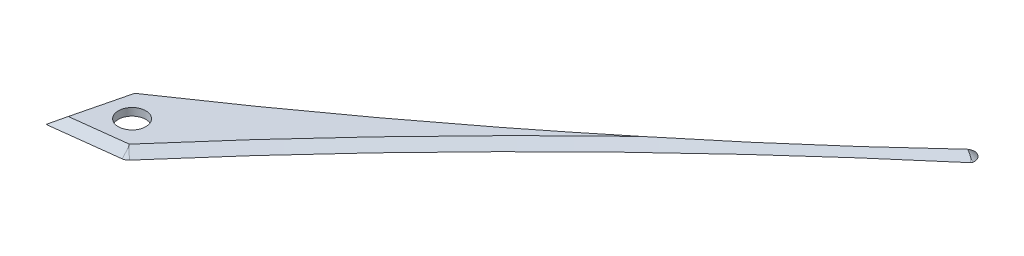
ISO-10303-21;
HEADER;
FILE_DESCRIPTION(('STEP AP214'),'2;1');
FILE_NAME('part.step','',(''),(''),'','','');
FILE_SCHEMA(('AUTOMOTIVE_DESIGN { 1 0 10303 214 1 1 1 1 }'));
ENDSEC;
DATA;
#1=APPLICATION_CONTEXT('core data for automotive mechanical design processes');
#2=APPLICATION_PROTOCOL_DEFINITION('international standard','automotive_design',2000,#1);
#3=PRODUCT_CONTEXT('',#1,'mechanical');
#4=PRODUCT('Part','Part','',(#3));
#5=PRODUCT_RELATED_PRODUCT_CATEGORY('part','',(#4));
#6=PRODUCT_DEFINITION_FORMATION('','',#4);
#7=PRODUCT_DEFINITION_CONTEXT('part definition',#1,'design');
#8=PRODUCT_DEFINITION('design','',#6,#7);
#9=PRODUCT_DEFINITION_SHAPE('','',#8);
#10=(LENGTH_UNIT() NAMED_UNIT(*) SI_UNIT(.MILLI.,.METRE.));
#11=(NAMED_UNIT(*) PLANE_ANGLE_UNIT() SI_UNIT($,.RADIAN.));
#12=(NAMED_UNIT(*) SI_UNIT($,.STERADIAN.) SOLID_ANGLE_UNIT());
#13=UNCERTAINTY_MEASURE_WITH_UNIT(LENGTH_MEASURE(1.E-05),#10,'distance_accuracy_value','');
#14=(GEOMETRIC_REPRESENTATION_CONTEXT(3) GLOBAL_UNCERTAINTY_ASSIGNED_CONTEXT((#13)) GLOBAL_UNIT_ASSIGNED_CONTEXT((#10,
#11,#12)) REPRESENTATION_CONTEXT('',''));
#15=CARTESIAN_POINT('',(0.,0.,0.));
#16=DIRECTION('',(0.,0.,1.));
#17=DIRECTION('',(1.,0.,0.));
#18=AXIS2_PLACEMENT_3D('',#15,#16,#17);
#19=CARTESIAN_POINT('',(-41.4295612310237,1.23498613795335,35.911720589093));
#20=DIRECTION('',(0.,-1.,0.));
#21=DIRECTION('',(0.,0.,1.));
#22=AXIS2_PLACEMENT_3D('',#19,#20,#21);
#23=CONICAL_SURFACE('',#22,0.17544,0.872664625997167);
#24=DIRECTION('',(-0.743844620437363,-0.642787609686538,-0.183082684817168));
#25=VECTOR('',#24,1.);
#26=CARTESIAN_POINT('',(-41.5999170130958,1.23498613795335,35.8697908727262));
#27=LINE('',#26,#25);
#28=CARTESIAN_POINT('',(-41.4295612310237,1.38219777724709,35.911720589093));
#29=VERTEX_POINT('',#28);
#30=CARTESIAN_POINT('',(-41.5999170130958,1.23498613795335,35.8697908727262));
#31=VERTEX_POINT('',#30);
#32=EDGE_CURVE('E239',#29,#31,#27,.T.);
#33=ORIENTED_EDGE('',*,*,#32,.F.);
#34=DIRECTION('',(-0.426164389285027,-0.642787609686538,-0.636559504004761));
#35=VECTOR('',#34,1.);
#36=CARTESIAN_POINT('',(-41.5271616785274,1.23498613795335,35.7659353146409));
#37=LINE('',#36,#35);
#38=CARTESIAN_POINT('',(-41.5271616785274,1.23498613795335,35.7659353146409));
#39=VERTEX_POINT('',#38);
#40=EDGE_CURVE('E12',#29,#39,#37,.T.);
#41=ORIENTED_EDGE('',*,*,#40,.T.);
#42=CARTESIAN_POINT('',(-41.4295612310237,1.23498613795335,35.911720589093));
#43=DIRECTION('',(0.,1.,0.));
#44=DIRECTION('',(0.,0.,1.));
#45=AXIS2_PLACEMENT_3D('',#42,#43,#44);
#46=CIRCLE('',#45,0.17544);
#47=EDGE_CURVE('E238',#31,#39,#46,.F.);
#48=ORIENTED_EDGE('',*,*,#47,.F.);
#49=EDGE_LOOP('',(#33,#41,#48));
#50=FACE_BOUND('',#49,.T.);
#51=ADVANCED_FACE('F94',(#50),#23,.T.);
#52=CARTESIAN_POINT('',(-48.2539668191453,1.23498613795335,32.2725586456981));
#53=DIRECTION('',(0.,1.,0.));
#54=DIRECTION('',(0.,0.,1.));
#55=AXIS2_PLACEMENT_3D('',#52,#53,#54);
#56=PLANE('',#55);
#57=CARTESIAN_POINT('',(-40.9169721093054,1.23498613795335,36.4773777946306));
#58=DIRECTION('',(0.,1.,0.));
#59=DIRECTION('',(0.,0.,1.));
#60=AXIS2_PLACEMENT_3D('',#57,#58,#59);
#61=CIRCLE('',#60,0.32164);
#62=CARTESIAN_POINT('',(-40.9169721093054,1.23498613795335,36.7990177946306));
#63=VERTEX_POINT('',#62);
#64=EDGE_CURVE('E314',#63,#63,#61,.T.);
#65=ORIENTED_EDGE('',*,*,#64,.T.);
#66=EDGE_LOOP('',(#65));
#67=FACE_BOUND('',#66,.T.);
#68=CARTESIAN_POINT('',(-41.5271616785274,1.23498613795335,35.7659353146409));
#69=CARTESIAN_POINT('',(-41.2057811120871,1.23498613795335,35.5507780039952));
#70=CARTESIAN_POINT('',(-40.8858527182257,1.23498613795335,35.333451650702));
#71=CARTESIAN_POINT('',(-40.2492418621971,1.23498613795335,34.894699299918));
#72=CARTESIAN_POINT('',(-39.9325567508154,1.23498613795335,34.6732771463246));
#73=CARTESIAN_POINT('',(-39.3024233738779,1.23498613795335,34.2263457961842));
#74=CARTESIAN_POINT('',(-38.9889729599727,1.23498613795335,34.0008396285886));
#75=CARTESIAN_POINT('',(-38.365299309899,1.23498613795335,33.5457536261096));
#76=CARTESIAN_POINT('',(-38.0550744435247,1.23498613795335,33.3161760253136));
#77=CARTESIAN_POINT('',(-37.4378423870001,1.23498613795335,32.8529602544979));
#78=CARTESIAN_POINT('',(-37.1308341000104,1.23498613795335,32.619323545983));
#79=CARTESIAN_POINT('',(-36.5200256682486,1.23498613795335,32.1480026603006));
#80=CARTESIAN_POINT('',(-36.2162249738218,1.23498613795335,31.9103191954422));
#81=CARTESIAN_POINT('',(-35.6118277650167,1.23498613795335,31.430922223419));
#82=CARTESIAN_POINT('',(-35.3112312016629,1.23498613795335,31.1892087779982));
#83=CARTESIAN_POINT('',(-34.7132261327837,1.23498613795335,30.7017597881303));
#84=CARTESIAN_POINT('',(-34.4158182173654,1.23498613795335,30.4560235197588));
#85=CARTESIAN_POINT('',(-33.8241800762311,1.23498613795335,29.9605409735351));
#86=CARTESIAN_POINT('',(-33.5299510300754,1.23498613795335,29.7107932872633));
#87=CARTESIAN_POINT('',(-32.9446602616333,1.23498613795335,29.2072999196093));
#88=CARTESIAN_POINT('',(-32.6536003159474,1.23498613795335,28.9535521730698));
#89=CARTESIAN_POINT('',(-32.0746376565497,1.23498613795335,28.4420704745345));
#90=CARTESIAN_POINT('',(-31.7867373225919,1.23498613795335,28.1843338289877));
#91=CARTESIAN_POINT('',(-31.2140830599226,1.23498613795335,27.6648864548719));
#92=CARTESIAN_POINT('',(-30.929332117825,1.23498613795335,27.4031724336872));
#93=CARTESIAN_POINT('',(-30.6462986840173,1.23498613795335,27.1396145595264));
#94=B_SPLINE_CURVE_WITH_KNOTS('',3,(#68,#69,#70,#71,#72,#73,#74,#75,#76,#77,#78,#79,#80,#81,#82,
#83,#84,#85,#86,#87,#88,#89,#90,#91,#92,#93),.UNSPECIFIED.,.F.,.F.,(4,2,2,2,2,2,2,2,2,2,2,2,4),
(0.,1.16025112051873,2.3194636529408,3.47784905451846,4.63561736992129,5.79297712574353,
6.95013522739013,8.10727561627494,9.26462657791227,10.422393178553,11.580778474926,
12.7399834328891,13.9002068496202),.UNSPECIFIED.);
#95=CARTESIAN_POINT('',(-30.6462986840173,1.23498613795335,27.1396145595264));
#96=VERTEX_POINT('',#95);
#97=EDGE_CURVE('E231',#39,#96,#94,.T.);
#98=ORIENTED_EDGE('',*,*,#97,.T.);
#99=CARTESIAN_POINT('',(-30.6064458298212,1.23498613795335,27.1824124614893));
#100=DIRECTION('',(0.,1.,0.));
#101=DIRECTION('',(0.,0.,1.));
#102=AXIS2_PLACEMENT_3D('',#99,#100,#101);
#103=CIRCLE('',#102,0.0584799999999992);
#104=CARTESIAN_POINT('',(-30.6059550477662,1.23498613795335,27.1239345209221));
#105=VERTEX_POINT('',#104);
#106=EDGE_CURVE('E274',#105,#96,#103,.T.);
#107=ORIENTED_EDGE('',*,*,#106,.F.);
#108=CARTESIAN_POINT('',(-30.607764340602,1.23498613795335,27.3395164026345));
#109=DIRECTION('',(0.,1.,0.));
#110=DIRECTION('',(0.,0.,1.));
#111=AXIS2_PLACEMENT_3D('',#108,#109,#110);
#112=CIRCLE('',#111,0.215589473915584);
#113=CARTESIAN_POINT('',(-30.3935238800785,1.23498613795335,27.3635964013441));
#114=VERTEX_POINT('',#113);
#115=EDGE_CURVE('E306',#114,#105,#112,.T.);
#116=ORIENTED_EDGE('',*,*,#115,.F.);
#117=CARTESIAN_POINT('',(-30.4516379517159,1.23498613795335,27.3570645503267));
#118=DIRECTION('',(0.,-1.,0.));
#119=DIRECTION('',(0.,0.,-1.));
#120=AXIS2_PLACEMENT_3D('',#117,#118,#119);
#121=CIRCLE('',#120,0.0584800000000016);
#122=CARTESIAN_POINT('',(-30.4139329881333,1.23498613795335,27.4017662966151));
#123=VERTEX_POINT('',#122);
#124=EDGE_CURVE('E310',#114,#123,#121,.T.);
#125=ORIENTED_EDGE('',*,*,#124,.T.);
#126=CARTESIAN_POINT('',(-40.2839139579828,1.23498613795335,37.1685500522957));
#127=CARTESIAN_POINT('',(-40.0317369811087,1.23498613795335,36.8753182171465));
#128=CARTESIAN_POINT('',(-39.7775809468083,1.23498613795335,36.5837884051827));
#129=CARTESIAN_POINT('',(-39.2655884810995,1.23498613795335,36.0044433246039));
#130=CARTESIAN_POINT('',(-39.0077555478141,1.23498613795335,35.7166249645458));
#131=CARTESIAN_POINT('',(-38.4884207037036,1.23498613795335,35.144692255075));
#132=CARTESIAN_POINT('',(-38.2269215420661,1.23498613795335,34.8605754092811));
#133=CARTESIAN_POINT('',(-37.7002663597585,1.23498613795335,34.2960345246697));
#134=CARTESIAN_POINT('',(-37.4351123613513,1.23498613795335,34.015608599276));
#135=CARTESIAN_POINT('',(-36.9011593684114,1.23498613795335,33.4584385504894));
#136=CARTESIAN_POINT('',(-36.6323616931641,1.23498613795335,33.1816931627631));
#137=CARTESIAN_POINT('',(-36.0911332080395,1.23498613795335,32.6318731517761));
#138=CARTESIAN_POINT('',(-35.8187030393467,1.23498613795335,32.3587978973361));
#139=CARTESIAN_POINT('',(-35.2702263921133,1.23498613795335,31.8163121277199));
#140=CARTESIAN_POINT('',(-34.9941799689919,1.23498613795335,31.546901556511));
#141=CARTESIAN_POINT('',(-34.4384767636104,1.23498613795335,31.0117281942658));
#142=CARTESIAN_POINT('',(-34.15881933349,1.23498613795335,30.7459660759626));
#143=CARTESIAN_POINT('',(-33.5959048717705,1.23498613795335,30.2180778752568));
#144=CARTESIAN_POINT('',(-33.3126465835165,1.23498613795335,29.9559531329388));
#145=CARTESIAN_POINT('',(-32.7425410888338,1.23498613795335,29.4353279512313));
#146=CARTESIAN_POINT('',(-32.4556920454229,1.23498613795335,29.176829523478));
#147=CARTESIAN_POINT('',(-31.8784155335187,1.23498613795335,28.6634455368581));
#148=CARTESIAN_POINT('',(-31.587985676589,1.23498613795335,28.4085626638464));
#149=CARTESIAN_POINT('',(-31.0035582729127,1.23498613795335,27.9023975832039));
#150=CARTESIAN_POINT('',(-30.7095578158369,1.23498613795335,27.6511187358062));
#151=CARTESIAN_POINT('',(-30.4139329881333,1.23498613795335,27.4017662966151));
#152=B_SPLINE_CURVE_WITH_KNOTS('',3,(#126,#127,#128,#129,#130,#131,#132,#133,#134,#135,#136,
#137,#138,#139,#140,#141,#142,#143,#144,#145,#146,#147,#148,#149,#150,#151),.UNSPECIFIED.,.F.,
.F.,(4,2,2,2,2,2,2,2,2,2,2,2,4),(0.,1.1602511205207,2.31946365294381,3.47784905452197,
4.63561736992512,5.79297712574767,6.95013522739472,8.10727561627912,9.26462657791633,
10.4223931785573,11.5807784749308,12.7399834328945,13.9002068496263),.UNSPECIFIED.);
#153=CARTESIAN_POINT('',(-40.2839139579828,1.23498613795335,37.1685500522957));
#154=VERTEX_POINT('',#153);
#155=EDGE_CURVE('E313',#154,#123,#152,.T.);
#156=ORIENTED_EDGE('',*,*,#155,.F.);
#157=CARTESIAN_POINT('',(-40.4169303058324,1.23498613795335,37.0541566748443));
#158=DIRECTION('',(0.,1.,0.));
#159=DIRECTION('',(0.,0.,1.));
#160=AXIS2_PLACEMENT_3D('',#157,#158,#159);
#161=CIRCLE('',#160,0.175440000000001);
#162=CARTESIAN_POINT('',(-40.3957514677221,1.23498613795335,37.2283136454665));
#163=VERTEX_POINT('',#162);
#164=EDGE_CURVE('E315',#163,#154,#161,.T.);
#165=ORIENTED_EDGE('',*,*,#164,.F.);
#166=DIRECTION('',(0.992686791052104,0.,-0.120718411481752));
#167=VECTOR('',#166,1.);
#168=CARTESIAN_POINT('',(-41.9817620424015,1.23498613795335,37.4211848299069));
#169=LINE('',#168,#167);
#170=CARTESIAN_POINT('',(-41.9817620424015,1.23498613795335,37.4211848299069));
#171=VERTEX_POINT('',#170);
#172=EDGE_CURVE('E165',#171,#163,#169,.T.);
#173=ORIENTED_EDGE('',*,*,#172,.F.);
#174=DIRECTION('',(0.238997471310854,0.,-0.971020189649534));
#175=VECTOR('',#174,1.);
#176=CARTESIAN_POINT('',(-41.1451803384308,1.23498613795335,34.022246253731));
#177=LINE('',#176,#175);
#178=EDGE_CURVE('E291',#171,#31,#177,.T.);
#179=ORIENTED_EDGE('',*,*,#178,.T.);
#180=ORIENTED_EDGE('',*,*,#47,.T.);
#181=EDGE_LOOP('',(#98,#107,#116,#125,#156,#165,#173,#179,#180));
#182=FACE_BOUND('',#181,.T.);
#183=ADVANCED_FACE('F210',(#67,#182),#56,.F.);
#184=CARTESIAN_POINT('',(-50.3206273852521,-12.0282778620466,22.6311818967251));
#185=CARTESIAN_POINT('',(-47.1899763568929,-12.028277862425,20.5352710305602));
#186=CARTESIAN_POINT('',(-44.2296026361147,-12.0282778624295,18.1898026091209));
#187=CARTESIAN_POINT('',(-41.4181152786696,-12.0282778620466,15.5717818439323));
#188=CARTESIAN_POINT('',(-38.6066279212244,-12.0282778616638,12.9537610787437));
#189=CARTESIAN_POINT('',(-35.7951405637793,-12.028277861281,10.335740313555));
#190=CARTESIAN_POINT('',(-32.9836532063341,-12.0282778608982,7.71771954836652));
#191=CARTESIAN_POINT('',(-45.8541051215189,-5.29138186204665,29.3028026804283));
#192=CARTESIAN_POINT('',(-42.3652583797618,-5.29138186223283,26.9670866466353));
#193=CARTESIAN_POINT('',(-39.0663040313441,-5.29138186223502,24.3524261844411));
#194=CARTESIAN_POINT('',(-35.9467163734494,-5.29138186204665,21.4475063978849));
#195=CARTESIAN_POINT('',(-32.8271287155546,-5.29138186185828,18.5425866113286));
#196=CARTESIAN_POINT('',(-29.7075410576598,-5.2913818616699,15.6376668247724));
#197=CARTESIAN_POINT('',(-26.587953399765,-5.29138186148153,12.7327470382162));
#198=CARTESIAN_POINT('',(-43.6208439896523,-1.92293386204665,32.63861307228));
#199=CARTESIAN_POINT('',(-39.9528993911963,-1.92293386213674,30.1829944546729));
#200=CARTESIAN_POINT('',(-36.4846547289589,-1.9229338621378,27.4337379721012));
#201=CARTESIAN_POINT('',(-33.2110169208393,-1.92293386204665,24.3853686748611));
#202=CARTESIAN_POINT('',(-29.9373791127197,-1.9229338619555,21.3369993776211));
#203=CARTESIAN_POINT('',(-26.6637413046001,-1.92293386186435,18.288630080381));
#204=CARTESIAN_POINT('',(-23.3901034964805,-1.92293386177321,15.240260783141));
#205=CARTESIAN_POINT('',(-42.504213423719,-0.23870986204665,34.3065182682058));
#206=CARTESIAN_POINT('',(-38.7467198969135,-0.23870986208869,31.7909483586917));
#207=CARTESIAN_POINT('',(-35.1938300777662,-0.238709862089185,28.9743938659312));
#208=CARTESIAN_POINT('',(-31.8431671945342,-0.23870986204665,25.8542998133493));
#209=CARTESIAN_POINT('',(-28.4925043113022,-0.238709862004114,22.7342057607673));
#210=CARTESIAN_POINT('',(-25.1418414280702,-0.238709861961578,19.6141117081854));
#211=CARTESIAN_POINT('',(-21.7911785448382,-0.238709861919043,16.4940176556035));
#212=CARTESIAN_POINT('',(-41.9458981407524,0.60340213795335,35.1404708661687));
#213=CARTESIAN_POINT('',(-38.1436301497722,0.603402137935333,32.5949253107011));
#214=CARTESIAN_POINT('',(-34.5484177521699,0.603402137935121,29.7447218128463));
#215=CARTESIAN_POINT('',(-31.1592423313817,0.60340213795335,26.5887653825934));
#216=CARTESIAN_POINT('',(-27.7700669105935,0.60340213797158,23.4328089523405));
#217=CARTESIAN_POINT('',(-24.3808914898053,0.60340213798981,20.2768525220876));
#218=CARTESIAN_POINT('',(-20.9917160690171,0.603402138008039,17.1208960918347));
#219=CARTESIAN_POINT('',(-41.6667404992691,1.02445813795335,35.5574471651502));
#220=CARTESIAN_POINT('',(-37.8420852762015,1.02445813794734,32.9969137867058));
#221=CARTESIAN_POINT('',(-34.2257115893718,1.02445813794727,30.1298857863038));
#222=CARTESIAN_POINT('',(-30.8172798998054,1.02445813795335,26.9559981672154));
#223=CARTESIAN_POINT('',(-27.4088482102391,1.02445813795943,23.782110548127));
#224=CARTESIAN_POINT('',(-24.0004165206728,1.0244581379655,20.6082229290386));
#225=CARTESIAN_POINT('',(-20.5919848311065,1.02445813797158,17.4343353099503));
#226=CARTESIAN_POINT('',(-41.5271616785274,1.23498613795335,35.7659353146409));
#227=CARTESIAN_POINT('',(-37.6913128394161,1.23498613795335,33.1979080247081));
#228=CARTESIAN_POINT('',(-34.0643585079727,1.23498613795335,30.3224677730325));
#229=CARTESIAN_POINT('',(-30.6462986840173,1.23498613795335,27.1396145595264));
#230=CARTESIAN_POINT('',(-27.2282388600619,1.23498613795335,23.9567613460203));
#231=CARTESIAN_POINT('',(-23.8101790361066,1.23498613795335,20.7739081325142));
#232=CARTESIAN_POINT('',(-20.3921192121512,1.23498613795335,17.5910549190081));
#233=CARTESIAN_POINT('',(-41.3875828577858,1.44551413795335,35.9744234641316));
#234=CARTESIAN_POINT('',(-37.5405404026308,1.44551413795936,33.3989022627105));
#235=CARTESIAN_POINT('',(-33.9030054265736,1.44551413795943,30.5150497597613));
#236=CARTESIAN_POINT('',(-30.4753174682292,1.44551413795335,27.3232309518374));
#237=CARTESIAN_POINT('',(-27.0476295098848,1.44551413794727,24.1314121439136));
#238=CARTESIAN_POINT('',(-23.6199415515403,1.4455141379412,20.9395933359897));
#239=CARTESIAN_POINT('',(-20.1922535931959,1.44551413793512,17.7477745280659));
#240=B_SPLINE_SURFACE_WITH_KNOTS('',1,3,((#184,#185,#186,#187,#188,#189,#190),(#191,#192,#193,
#194,#195,#196,#197),(#198,#199,#200,#201,#202,#203,#204),(#205,#206,#207,#208,#209,#210,#211),
(#212,#213,#214,#215,#216,#217,#218),(#219,#220,#221,#222,#223,#224,#225),(#226,#227,#228,#229,
#230,#231,#232),(#233,#234,#235,#236,#237,#238,#239)),.UNSPECIFIED.,.F.,.F.,.F.,(2,1,1,1,1,1,1,
2),(4,3,4),(-63.,-31.,-15.,-7.,-3.,-1.,0.,1.),(0.00487671661212311,0.998495961179001,
1.99211520574588),.UNSPECIFIED.);
#241=CARTESIAN_POINT('',(-41.400010791062,1.41042613795335,35.9324202912353));
#242=CARTESIAN_POINT('',(-41.4098609377159,1.4010166843846,35.9255203905212));
#243=CARTESIAN_POINT('',(-41.4197110843698,1.39160723081584,35.9186204898071));
#244=CARTESIAN_POINT('',(-41.4295612310237,1.38219777724709,35.911720589093));
#245=B_SPLINE_CURVE_WITH_KNOTS('',3,(#241,#242,#243,#244),.UNSPECIFIED.,.F.,.F.,(4,4),(0.,
0.045809895425271),.UNSPECIFIED.);
#246=CARTESIAN_POINT('',(-41.400010791062,1.41042613795335,35.9324202912353));
#247=VERTEX_POINT('',#246);
#248=EDGE_CURVE('E109',#247,#29,#245,.T.);
#249=CARTESIAN_POINT('',(-41.400010791062,1.41042613795335,35.9324202912353));
#250=CARTESIAN_POINT('',(-41.0356579158636,1.41042613795335,35.688414535706));
#251=CARTESIAN_POINT('',(-40.6731681502119,1.41042613795335,35.4416268832976));
#252=CARTESIAN_POINT('',(-39.9519227396242,1.41042613795335,34.9424987487698));
#253=CARTESIAN_POINT('',(-39.5931678703379,1.41042613795335,34.6901571458236));
#254=CARTESIAN_POINT('',(-38.8794996960265,1.41042613795335,34.1799965325503));
#255=CARTESIAN_POINT('',(-38.5245869248353,1.41042613795335,33.9221767754479));
#256=CARTESIAN_POINT('',(-37.8187047905837,1.41042613795335,33.4011430910007));
#257=CARTESIAN_POINT('',(-37.4677357059938,1.41042613795335,33.1379287863976));
#258=CARTESIAN_POINT('',(-36.7706048328058,1.41042613795335,32.6067792671196));
#259=CARTESIAN_POINT('',(-36.4244341851292,1.41042613795335,32.3388556794927));
#260=CARTESIAN_POINT('',(-35.7362011243777,1.41042613795335,31.7978165162962));
#261=CARTESIAN_POINT('',(-35.3941385159606,1.41042613795335,31.5247011892082));
#262=CARTESIAN_POINT('',(-34.7142017281827,1.41042613795335,30.9733735135534));
#263=CARTESIAN_POINT('',(-34.3763271418575,1.41042613795335,30.6951616668473));
#264=CARTESIAN_POINT('',(-33.7048417438413,1.41042613795335,30.1337408551005));
#265=CARTESIAN_POINT('',(-33.3712302964526,1.41042613795335,29.8505326504452));
#266=CARTESIAN_POINT('',(-32.7750423881498,1.41042613795335,29.3367109342138));
#267=CARTESIAN_POINT('',(-32.5116929575249,1.41042613795335,29.1069938283351));
#268=CARTESIAN_POINT('',(-32.1187300596571,1.41042613795335,28.7600853570458));
#269=CARTESIAN_POINT('',(-31.9880856556607,1.41042613795335,28.6440601151229));
#270=CARTESIAN_POINT('',(-31.7274851194129,1.41042613795335,28.4112389934792));
#271=CARTESIAN_POINT('',(-31.597528986873,1.41042613795335,28.2944431140815));
#272=CARTESIAN_POINT('',(-31.3383012381354,1.41042613795335,28.0600695429332));
#273=CARTESIAN_POINT('',(-31.209029688811,1.41042613795335,27.9424917772458));
#274=CARTESIAN_POINT('',(-30.951165284455,1.41042613795335,27.7065940616357));
#275=CARTESIAN_POINT('',(-30.8225724286987,1.41042613795335,27.5882741125058));
#276=CARTESIAN_POINT('',(-30.5661295675887,1.41042613795335,27.3507978138263));
#277=CARTESIAN_POINT('',(-30.4382796671448,1.41042613795335,27.2316413511607));
#278=CARTESIAN_POINT('',(-30.1825140590829,1.41042613795335,26.9933993743522));
#279=CARTESIAN_POINT('',(-30.0545983513383,1.41042613795335,26.8743138603465));
#280=CARTESIAN_POINT('',(-29.7987801326642,1.41042613795335,26.6361196920666));
#281=CARTESIAN_POINT('',(-29.6708776223347,1.41042613795335,26.5170110371407));
#282=CARTESIAN_POINT('',(-29.4150679829026,1.41042613795335,26.2787989184836));
#283=CARTESIAN_POINT('',(-29.2871608538032,1.41042613795335,26.1596954547488));
#284=CARTESIAN_POINT('',(-29.0310697500681,1.41042613795335,25.9212281971072));
#285=CARTESIAN_POINT('',(-28.90288577817,1.41042613795335,25.8018644002281));
#286=CARTESIAN_POINT('',(-28.6465174798889,1.41042613795335,25.5631371438603));
#287=CARTESIAN_POINT('',(-28.5183331535056,1.41042613795335,25.4437736843717));
#288=CARTESIAN_POINT('',(-28.1337948492224,1.41042613795335,25.0856967877857));
#289=CARTESIAN_POINT('',(-27.8774409621215,1.41042613795335,24.8469832521084));
#290=CARTESIAN_POINT('',(-27.3647662909568,1.41042613795335,24.36958713612));
#291=CARTESIAN_POINT('',(-27.1084455069014,1.41042613795335,24.1309045557999));
#292=CARTESIAN_POINT('',(-26.5958557296499,1.41042613795335,23.653587589582));
#293=CARTESIAN_POINT('',(-26.3395867364507,1.41042613795335,23.4149532036878));
#294=CARTESIAN_POINT('',(-25.8271191318689,1.41042613795335,22.9377499705435));
#295=CARTESIAN_POINT('',(-25.5709205204863,1.41042613795335,22.6991811232935));
#296=CARTESIAN_POINT('',(-25.3147219010414,1.41042613795335,22.4606122847967));
#297=B_SPLINE_CURVE_WITH_KNOTS('',3,(#249,#250,#251,#252,#253,#254,#255,#256,#257,#258,#259,
#260,#261,#262,#263,#264,#265,#266,#267,#268,#269,#270,#271,#272,#273,#274,#275,#276,#277,#278,
#279,#280,#281,#282,#283,#284,#285,#286,#287,#288,#289,#290,#291,#292,#293,#294,#295,#296),
.UNSPECIFIED.,.F.,.F.,(4,2,2,2,2,2,2,2,2,2,2,2,2,2,2,2,2,2,2,2,2,2,2,4),(0.,1.31551988503589,
2.63130773070652,3.94727610853962,5.26333683249591,6.57650959213769,7.88961965957243,
9.20260111114729,10.5153844376505,11.5637412408201,12.0879221717903,12.6121028830101,
13.1363338874663,13.6605643320423,14.1848670851547,14.7091708501196,15.2334925264792,
15.7578138438489,16.2832751775148,16.8087366076656,17.8595996840628,18.9103267975728,
19.9608416727279,21.0110680340601),.UNSPECIFIED.);
#298=CARTESIAN_POINT('',(-34.6013374463755,1.41042613795335,30.8793342351655));
#299=VERTEX_POINT('',#298);
#300=EDGE_CURVE('E272',#247,#299,#297,.T.);
#301=CARTESIAN_POINT('',(-29.1569689940605,1.41969833929217,26.0535624203083));
#302=CARTESIAN_POINT('',(-29.2326155257274,1.41761694929353,26.1206138889237));
#303=CARTESIAN_POINT('',(-29.3082620546448,1.41553538413087,26.187665355102));
#304=CARTESIAN_POINT('',(-29.459555118598,1.41137225363712,26.3217682928819));
#305=CARTESIAN_POINT('',(-29.5352016536338,1.40929068830602,26.3888197644835));
#306=CARTESIAN_POINT('',(-29.6864955127867,1.40512788641177,26.5229234071115));
#307=CARTESIAN_POINT('',(-29.7621428369038,1.40304664985224,26.589975578138));
#308=CARTESIAN_POINT('',(-29.9134374570228,1.39888277556765,26.7240798952701));
#309=CARTESIAN_POINT('',(-29.9890847530247,1.39680013784269,26.7911320413758));
#310=CARTESIAN_POINT('',(-30.1403877378629,1.39263988888973,26.9252437728165));
#311=CARTESIAN_POINT('',(-30.2160434267084,1.39056227823905,26.9923033581594));
#312=CARTESIAN_POINT('',(-30.3673545147519,1.38638743445665,27.126422272108));
#313=CARTESIAN_POINT('',(-30.4430099139497,1.38429020132017,27.1934816007135));
#314=CARTESIAN_POINT('',(-30.5564936755659,1.38119928087234,27.2940711811308));
#315=CARTESIAN_POINT('',(-30.5943216069132,1.38017813155048,27.3276010508504));
#316=CARTESIAN_POINT('',(-30.6699787061866,1.37822164398022,27.3946618863665));
#317=CARTESIAN_POINT('',(-30.707807874112,1.3772863056993,27.4281928521625));
#318=CARTESIAN_POINT('',(-30.8212967347295,1.37458483434179,27.5287869522254));
#319=CARTESIAN_POINT('',(-30.8969578177839,1.37292324382895,27.5958513188798));
#320=CARTESIAN_POINT('',(-31.1239471516172,1.36837476955519,27.7970498121645));
#321=CARTESIAN_POINT('',(-31.275280458251,1.36592421158768,27.9311884201963));
#322=CARTESIAN_POINT('',(-31.5779553786925,1.36218167739755,28.199472999561));
#323=CARTESIAN_POINT('',(-31.7292969925297,1.36088970557146,28.33361897092));
#324=CARTESIAN_POINT('',(-32.1829883151881,1.35876214845198,28.7357612610146));
#325=CARTESIAN_POINT('',(-32.4853437002725,1.35966811359701,29.003762611068));
#326=CARTESIAN_POINT('',(-33.0900170622323,1.36614937622247,29.5397321533368));
#327=CARTESIAN_POINT('',(-33.3923350399443,1.37172453683336,29.8077003462939));
#328=CARTESIAN_POINT('',(-33.9968989485442,1.38755965840446,30.3435728714424));
#329=CARTESIAN_POINT('',(-34.2991448800704,1.39781957619316,30.6114772041995));
#330=CARTESIAN_POINT('',(-35.0546778426186,1.42933813096994,31.2811654715832));
#331=CARTESIAN_POINT('',(-35.5078981398046,1.45353127383378,31.6828902547638));
#332=CARTESIAN_POINT('',(-36.4139617488463,1.51247270784805,32.4860056693893));
#333=CARTESIAN_POINT('',(-36.866805052785,1.54722121532801,32.8873962938166));
#334=CARTESIAN_POINT('',(-37.7724858871341,1.62727224922374,33.6901724251452));
#335=CARTESIAN_POINT('',(-38.2253228261001,1.67258672515503,34.0915574078026));
#336=CARTESIAN_POINT('',(-39.1303298139975,1.77365083814932,34.8937362560556));
#337=CARTESIAN_POINT('',(-39.5824998836483,1.82940014381344,35.2945301400164));
#338=CARTESIAN_POINT('',(-40.0342781123943,1.89031966049701,35.6949767045817));
#339=B_SPLINE_CURVE_WITH_KNOTS('',3,(#301,#302,#303,#304,#305,#306,#307,#308,#309,#310,#311,
#312,#313,#314,#315,#316,#317,#318,#319,#320,#321,#322,#323,#324,#325,#326,#327,#328,#329,#330,
#331,#332,#333,#334,#335,#336,#337,#338),.UNSPECIFIED.,.F.,.F.,(4,2,2,2,2,2,2,2,2,2,2,2,2,2,2,2,
2,2,4),(0.,0.303321058200151,0.606642140933602,0.909966365608684,1.21329056575004,
1.51664808800729,1.82000568387668,1.97168368260048,2.12336162385752,2.42671737196108,
3.03343299337873,3.6401509171145,4.85222690401865,6.06426736221139,7.27629665129219,
9.09454732796604,10.9128352717406,12.7331896572855,14.5534862401524),.UNSPECIFIED.);
#340=CARTESIAN_POINT('',(-30.5763499260007,1.380662855646,27.3116713370602));
#341=VERTEX_POINT('',#340);
#342=EDGE_CURVE('E162',#341,#299,#339,.T.);
#343=CARTESIAN_POINT('',(-30.6064458298204,1.28405668438637,27.1824124614914));
#344=CARTESIAN_POINT('',(-30.6041290260869,1.28904218098463,27.1883736580631));
#345=CARTESIAN_POINT('',(-30.6018752485579,1.29401320427084,27.1943698478298));
#346=CARTESIAN_POINT('',(-30.5975215434005,1.30392330088891,27.2064531480633));
#347=CARTESIAN_POINT('',(-30.5954217511348,1.30886234271133,27.2125403329942));
#348=CARTESIAN_POINT('',(-30.5893278842228,1.32379324615689,27.2311779530345));
#349=CARTESIAN_POINT('',(-30.5856261411262,1.33371643524985,27.2438881865871));
#350=CARTESIAN_POINT('',(-30.581117099549,1.34830108526347,27.2634345082289));
#351=CARTESIAN_POINT('',(-30.5797875950559,1.35311503823602,27.2700336678034));
#352=CARTESIAN_POINT('',(-30.5776565026127,1.36254456773148,27.2833995483279));
#353=CARTESIAN_POINT('',(-30.5768516561437,1.36716119902644,27.2901649588693));
#354=CARTESIAN_POINT('',(-30.5761953340789,1.37457725901629,27.3016240980233));
#355=CARTESIAN_POINT('',(-30.5761133480155,1.37746277699003,27.3062437995213));
#356=CARTESIAN_POINT('',(-30.5765203587053,1.38300054598611,27.3156339889131));
#357=CARTESIAN_POINT('',(-30.5770132819558,1.38565105828845,27.3204052946703));
#358=CARTESIAN_POINT('',(-30.5779026010895,1.38811334755944,27.3252385119324));
#359=B_SPLINE_CURVE_WITH_KNOTS('',3,(#343,#344,#345,#346,#347,#348,#349,#350,#351,#352,#353,
#354,#355,#356,#357,#358),.UNSPECIFIED.,.F.,.F.,(4,2,2,2,2,2,2,4),(0.,0.0243244054918219,
0.0486699435084158,0.0982484501697752,0.123063526562295,0.147722976073802,0.164034263365526,
0.180457608515787),.UNSPECIFIED.);
#360=CARTESIAN_POINT('',(-30.6064458298204,1.28405668438637,27.1824124614914));
#361=VERTEX_POINT('',#360);
#362=EDGE_CURVE('E118',#341,#361,#359,.F.);
#363=DIRECTION('',(-0.52204270688956,-0.642787609686537,-0.560620639128537));
#364=VECTOR('',#363,1.);
#365=CARTESIAN_POINT('',(-30.6462986840173,1.23498613795335,27.1396145595264));
#366=LINE('',#365,#364);
#367=EDGE_CURVE('E280',#361,#96,#366,.T.);
#368=ORIENTED_EDGE('',*,*,#97,.F.);
#369=ORIENTED_EDGE('',*,*,#40,.F.);
#370=ORIENTED_EDGE('',*,*,#248,.F.);
#371=ORIENTED_EDGE('',*,*,#300,.T.);
#372=ORIENTED_EDGE('',*,*,#342,.F.);
#373=ORIENTED_EDGE('',*,*,#362,.T.);
#374=ORIENTED_EDGE('',*,*,#367,.T.);
#375=EDGE_LOOP('',(#368,#369,#370,#371,#372,#373,#374));
#376=FACE_BOUND('',#375,.T.);
#377=ADVANCED_FACE('F212',(#376),#240,.T.);
#378=CARTESIAN_POINT('',(-30.6064458298212,1.23498613795335,27.1824124614893));
#379=DIRECTION('',(0.,-1.,0.));
#380=DIRECTION('',(0.,0.,1.));
#381=AXIS2_PLACEMENT_3D('',#378,#379,#380);
#382=CONICAL_SURFACE('',#381,0.0584799999999992,0.872664625997167);
#383=ORIENTED_EDGE('',*,*,#367,.F.);
#384=DIRECTION('',(0.00642887937731658,-0.642787609686538,-0.766017466082477));
#385=VECTOR('',#384,1.);
#386=CARTESIAN_POINT('',(-30.6059550477662,1.23498613795335,27.1239345209221));
#387=LINE('',#386,#385);
#388=EDGE_CURVE('E279',#361,#105,#387,.T.);
#389=ORIENTED_EDGE('',*,*,#388,.T.);
#390=ORIENTED_EDGE('',*,*,#106,.T.);
#391=EDGE_LOOP('',(#383,#389,#390));
#392=FACE_BOUND('',#391,.T.);
#393=ADVANCED_FACE('F219',(#392),#382,.T.);
#394=CARTESIAN_POINT('',(-30.607764340602,1.23498613795335,27.3395164026345));
#395=DIRECTION('',(0.,-1.,0.));
#396=DIRECTION('',(0.,0.,1.));
#397=AXIS2_PLACEMENT_3D('',#394,#395,#396);
#398=CONICAL_SURFACE('',#397,0.215589473915584,0.872664625997167);
#399=ORIENTED_EDGE('',*,*,#115,.T.);
#400=ORIENTED_EDGE('',*,*,#388,.F.);
#401=ORIENTED_EDGE('',*,*,#362,.F.);
#402=CARTESIAN_POINT('',(-30.4516379517159,1.2840566843846,27.3570645503267));
#403=CARTESIAN_POINT('',(-30.4572779656244,1.28904218098293,27.3540489762156));
#404=CARTESIAN_POINT('',(-30.4629602847492,1.29401320426922,27.3510917724292));
#405=CARTESIAN_POINT('',(-30.4744336529152,1.30392330088745,27.3453191892933));
#406=CARTESIAN_POINT('',(-30.4802247921298,1.30886234270994,27.3425039353899));
#407=CARTESIAN_POINT('',(-30.4979962234594,1.32379324615573,27.3342170588243));
#408=CARTESIAN_POINT('',(-30.5101702471689,1.33371643524884,27.3290164736994));
#409=CARTESIAN_POINT('',(-30.5290340364499,1.34830108526265,27.3221938935685));
#410=CARTESIAN_POINT('',(-30.5354259062378,1.35311503823523,27.3200819063758));
#411=CARTESIAN_POINT('',(-30.5484393613935,1.36254456773078,27.3163619195334));
#412=CARTESIAN_POINT('',(-30.5550592547078,1.36716119902579,27.3147508422106));
#413=CARTESIAN_POINT('',(-30.5663567697652,1.37457725901575,27.3127238290541));
#414=CARTESIAN_POINT('',(-30.5709332315032,1.37746277698955,27.3120879347181));
#415=CARTESIAN_POINT('',(-30.5803043860858,1.38300054598576,27.311364902001));
#416=CARTESIAN_POINT('',(-30.5851003621767,1.38565105828817,27.3112815635621));
#417=CARTESIAN_POINT('',(-30.5900053814182,1.38811334755921,27.3115843239733));
#418=B_SPLINE_CURVE_WITH_KNOTS('',3,(#402,#403,#404,#405,#406,#407,#408,#409,#410,#411,#412,
#413,#414,#415,#416,#417),.UNSPECIFIED.,.F.,.F.,(4,2,2,2,2,2,2,4),(0.,0.0243244054921691,
0.0486699435091152,0.0982484501711836,0.123063526563909,0.147722976075618,0.16403426336771,
0.180457608518344),.UNSPECIFIED.);
#419=CARTESIAN_POINT('',(-30.4516379517159,1.2840566843846,27.3570645503267));
#420=VERTEX_POINT('',#419);
#421=EDGE_CURVE('E296',#341,#420,#418,.F.);
#422=ORIENTED_EDGE('',*,*,#421,.T.);
#423=DIRECTION('',(0.761251054119531,-0.642787609686538,0.0855623832964547));
#424=VECTOR('',#423,1.);
#425=CARTESIAN_POINT('',(-30.3935238800785,1.23498613795335,27.3635964013441));
#426=LINE('',#425,#424);
#427=EDGE_CURVE('E174',#420,#114,#426,.T.);
#428=ORIENTED_EDGE('',*,*,#427,.T.);
#429=EDGE_LOOP('',(#399,#400,#401,#422,#428));
#430=FACE_BOUND('',#429,.T.);
#431=ADVANCED_FACE('F245',(#430),#398,.T.);
#432=CARTESIAN_POINT('',(-41.1451803384308,1.23498613795335,34.022246253731));
#433=DIRECTION('',(-0.624159746662193,0.766044443118979,-0.153624613305031));
#434=DIRECTION('',(-0.775247183722689,-0.631657980342242,0.));
#435=AXIS2_PLACEMENT_3D('',#432,#433,#434);
#436=PLANE('',#435);
#437=ORIENTED_EDGE('',*,*,#178,.F.);
#438=DIRECTION('',(0.675510842785258,0.430317922477403,-0.598758371026478));
#439=VECTOR('',#438,1.);
#440=CARTESIAN_POINT('',(-41.9817620424015,1.23498613795335,37.4211848299069));
#441=LINE('',#440,#439);
#442=CARTESIAN_POINT('',(-41.706357240352,1.41042613795335,37.177071900545));
#443=VERTEX_POINT('',#442);
#444=EDGE_CURVE('E182',#443,#171,#441,.F.);
#445=ORIENTED_EDGE('',*,*,#444,.F.);
#446=DIRECTION('',(0.238997471310854,0.,-0.971020189649534));
#447=VECTOR('',#446,1.);
#448=CARTESIAN_POINT('',(-40.9421582231271,1.41042613795335,34.0722161438476));
#449=LINE('',#448,#447);
#450=EDGE_CURVE('E170',#443,#247,#449,.T.);
#451=ORIENTED_EDGE('',*,*,#450,.T.);
#452=ORIENTED_EDGE('',*,*,#248,.T.);
#453=ORIENTED_EDGE('',*,*,#32,.T.);
#454=EDGE_LOOP('',(#437,#445,#451,#452,#453));
#455=FACE_BOUND('',#454,.T.);
#456=ADVANCED_FACE('F228',(#455),#436,.T.);
#457=CARTESIAN_POINT('',(-48.2539668191453,1.41042613795335,32.2725586456981));
#458=DIRECTION('',(0.,1.,0.));
#459=DIRECTION('',(0.,0.,1.));
#460=AXIS2_PLACEMENT_3D('',#457,#458,#459);
#461=PLANE('',#460);
#462=CARTESIAN_POINT('',(-40.9169721093054,1.41042613795335,36.4773777946306));
#463=DIRECTION('',(0.,1.,0.));
#464=DIRECTION('',(0.,0.,1.));
#465=AXIS2_PLACEMENT_3D('',#462,#463,#464);
#466=CIRCLE('',#465,0.32164);
#467=CARTESIAN_POINT('',(-40.9169721093054,1.41042613795335,36.7990177946306));
#468=VERTEX_POINT('',#467);
#469=EDGE_CURVE('E317',#468,#468,#466,.T.);
#470=ORIENTED_EDGE('',*,*,#469,.F.);
#471=EDGE_LOOP('',(#470));
#472=FACE_BOUND('',#471,.T.);
#473=ORIENTED_EDGE('',*,*,#300,.F.);
#474=ORIENTED_EDGE('',*,*,#450,.F.);
#475=DIRECTION('',(-0.992686791052104,0.,0.120718411481752));
#476=VECTOR('',#475,1.);
#477=CARTESIAN_POINT('',(-41.2819608624,1.41042613795335,37.1254620100471));
#478=LINE('',#477,#476);
#479=CARTESIAN_POINT('',(-40.4339334275489,1.41042613795335,37.0223352980258));
#480=VERTEX_POINT('',#479);
#481=EDGE_CURVE('E164',#443,#480,#478,.F.);
#482=ORIENTED_EDGE('',*,*,#481,.T.);
#483=CARTESIAN_POINT('',(-40.4339334275489,1.41042613795335,37.0223352980258));
#484=CARTESIAN_POINT('',(-40.147958621257,1.41042613795335,36.6899044983453));
#485=CARTESIAN_POINT('',(-39.8594456586591,1.41042613795335,36.3596572485315));
#486=CARTESIAN_POINT('',(-39.2773552540613,1.41042613795335,35.7035363771231));
#487=CARTESIAN_POINT('',(-38.9837767924388,1.41042613795335,35.3776636601028));
#488=CARTESIAN_POINT('',(-38.3916431632506,1.41042613795335,34.730389468129));
#489=CARTESIAN_POINT('',(-38.0930873183845,1.41042613795335,34.4089886127851));
#490=CARTESIAN_POINT('',(-37.4910937823505,1.41042613795335,33.7707492608116));
#491=CARTESIAN_POINT('',(-37.1876557500765,1.41042613795335,33.4539110859215));
#492=CARTESIAN_POINT('',(-36.5766699240668,1.41042613795335,32.8255739259143));
#493=CARTESIAN_POINT('',(-36.2691326099672,1.41042613795335,32.5140647501771));
#494=CARTESIAN_POINT('',(-35.6493966401109,1.41042613795335,31.8957481243782));
#495=CARTESIAN_POINT('',(-35.3371982075924,1.41042613795335,31.5889404505613));
#496=CARTESIAN_POINT('',(-34.7082439064944,1.41042613795335,30.9800950444878));
#497=CARTESIAN_POINT('',(-34.3914884872997,1.41042613795335,30.6780568479707));
#498=CARTESIAN_POINT('',(-33.7535284374264,1.41042613795335,30.0788132060128));
#499=CARTESIAN_POINT('',(-33.4323244853334,1.41042613795335,29.7816070382012));
#500=CARTESIAN_POINT('',(-32.8506573332622,1.41042613795335,29.251403207286));
#501=CARTESIAN_POINT('',(-32.5909912789881,1.41042613795335,29.0175305675683));
#502=CARTESIAN_POINT('',(-32.1994236614326,1.41042613795335,28.669047960469));
#503=CARTESIAN_POINT('',(-32.0685560479841,1.41042613795335,28.553274540329));
#504=CARTESIAN_POINT('',(-31.8061383677555,1.41042613795335,28.3225034951638));
#505=CARTESIAN_POINT('',(-31.6745883012616,1.41042613795335,28.2075058698134));
#506=CARTESIAN_POINT('',(-31.4107941704162,1.41042613795335,27.9782840272528));
#507=CARTESIAN_POINT('',(-31.2785500406892,1.41042613795335,27.8640598853069));
#508=CARTESIAN_POINT('',(-31.0134064261778,1.41042613795335,27.6363744730495));
#509=CARTESIAN_POINT('',(-30.8805069420935,1.41042613795335,27.5229132019234));
#510=CARTESIAN_POINT('',(-30.6139667844706,1.41042613795335,27.2968285323188));
#511=CARTESIAN_POINT('',(-30.4803260112262,1.41042613795335,27.184205251569));
#512=CARTESIAN_POINT('',(-30.2131070015145,1.41042613795335,26.958884842736));
#513=CARTESIAN_POINT('',(-30.0795287651685,1.41042613795335,26.8461877145108));
#514=CARTESIAN_POINT('',(-29.8123509035132,1.41042613795335,26.6208093369843));
#515=CARTESIAN_POINT('',(-29.6787512776292,1.41042613795335,26.5081280883569));
#516=CARTESIAN_POINT('',(-29.4115566251354,1.41042613795335,26.2827603826242));
#517=CARTESIAN_POINT('',(-29.2779615985225,1.41042613795335,26.1700739255224));
#518=CARTESIAN_POINT('',(-29.010479867567,1.41042613795335,25.9444574146207));
#519=CARTESIAN_POINT('',(-28.876593160602,1.41042613795335,25.8315273638955));
#520=CARTESIAN_POINT('',(-28.6088200390746,1.41042613795335,25.6056668700258));
#521=CARTESIAN_POINT('',(-28.4749336245122,1.41042613795335,25.4927364268813));
#522=CARTESIAN_POINT('',(-28.0732895266535,1.41042613795335,25.1539580479947));
#523=CARTESIAN_POINT('',(-27.8055317563887,1.41042613795335,24.9281102142277));
#524=CARTESIAN_POINT('',(-27.2700509207724,1.41042613795335,24.4764436948454));
#525=CARTESIAN_POINT('',(-27.0023278554131,1.41042613795335,24.2506250092394));
#526=CARTESIAN_POINT('',(-26.466935787123,1.41042613795335,23.799033269697));
#527=CARTESIAN_POINT('',(-26.1992667841955,1.41042613795335,23.5732602157569));
#528=CARTESIAN_POINT('',(-25.664002291063,1.41042613795335,23.1217761142763));
#529=CARTESIAN_POINT('',(-25.3964068008581,1.41042613795335,22.8960650667357));
#530=CARTESIAN_POINT('',(-25.1288113183755,1.41042613795335,22.6703540101404));
#531=B_SPLINE_CURVE_WITH_KNOTS('',3,(#483,#484,#485,#486,#487,#488,#489,#490,#491,#492,#493,
#494,#495,#496,#497,#498,#499,#500,#501,#502,#503,#504,#505,#506,#507,#508,#509,#510,#511,#512,
#513,#514,#515,#516,#517,#518,#519,#520,#521,#522,#523,#524,#525,#526,#527,#528,#529,#530),
.UNSPECIFIED.,.F.,.F.,(4,2,2,2,2,2,2,2,2,2,2,2,2,2,2,2,2,2,2,2,2,2,2,4),(0.,1.31551988508059,
2.6313077307947,3.94727610867065,5.26333683266961,6.57650959235357,7.88961965983077,
9.20260111144836,10.5153844379944,11.5637412411945,12.0879221721798,12.6121028834147,
13.1363338878861,13.6605643324771,14.1848670856046,14.7091708505846,15.2334925269591,
15.7578138443439,16.283275178025,16.808736608191,17.8595996846188,18.9103267981595,
19.9608416733454,21.0110680347087),.UNSPECIFIED.);
#532=EDGE_CURVE('E155',#480,#299,#531,.T.);
#533=ORIENTED_EDGE('',*,*,#532,.T.);
#534=EDGE_LOOP('',(#473,#474,#482,#533));
#535=FACE_BOUND('',#534,.T.);
#536=ADVANCED_FACE('F168',(#472,#535),#461,.T.);
#537=CARTESIAN_POINT('',(-41.9817620424015,1.23498613795335,37.4211848299069));
#538=DIRECTION('',(0.0775962991615112,0.766044443118979,0.638086769587781));
#539=DIRECTION('',(0.,-0.640016507906312,0.768361158315157));
#540=AXIS2_PLACEMENT_3D('',#537,#538,#539);
#541=PLANE('',#540);
#542=ORIENTED_EDGE('',*,*,#172,.T.);
#543=DIRECTION('',(0.092475668297732,-0.642787609686538,0.760442200043077));
#544=VECTOR('',#543,1.);
#545=CARTESIAN_POINT('',(-40.3957514677221,1.23498613795335,37.2283136454665));
#546=LINE('',#545,#544);
#547=CARTESIAN_POINT('',(-40.4169303058259,1.38219777723626,37.0541566748566));
#548=VERTEX_POINT('',#547);
#549=EDGE_CURVE('E179',#548,#163,#546,.T.);
#550=ORIENTED_EDGE('',*,*,#549,.F.);
#551=CARTESIAN_POINT('',(-40.4339334275489,1.41042613795335,37.0223352980258));
#552=CARTESIAN_POINT('',(-40.4282657203071,1.40101668438127,37.0329424236345));
#553=CARTESIAN_POINT('',(-40.4225980130652,1.39160723080919,37.0435495492433));
#554=CARTESIAN_POINT('',(-40.4169303058234,1.38219777723711,37.0541566748521));
#555=B_SPLINE_CURVE_WITH_KNOTS('',3,(#551,#552,#553,#554),.UNSPECIFIED.,.F.,.F.,(4,4),(0.,
0.0458098954404046),.UNSPECIFIED.);
#556=EDGE_CURVE('E160',#480,#548,#555,.T.);
#557=ORIENTED_EDGE('',*,*,#556,.F.);
#558=ORIENTED_EDGE('',*,*,#481,.F.);
#559=ORIENTED_EDGE('',*,*,#444,.T.);
#560=EDGE_LOOP('',(#542,#550,#557,#558,#559));
#561=FACE_BOUND('',#560,.T.);
#562=ADVANCED_FACE('F178',(#561),#541,.T.);
#563=CARTESIAN_POINT('',(-40.4169303058324,1.23498613795335,37.0541566748443));
#564=DIRECTION('',(0.,-1.,0.));
#565=DIRECTION('',(0.,0.,1.));
#566=AXIS2_PLACEMENT_3D('',#563,#564,#565);
#567=CONICAL_SURFACE('',#566,0.175440000000001,0.872664625997167);
#568=DIRECTION('',(0.580805028024989,-0.642787609686537,0.499489347488372));
#569=VECTOR('',#568,1.);
#570=CARTESIAN_POINT('',(-40.2839139579828,1.23498613795335,37.1685500522957));
#571=LINE('',#570,#569);
#572=EDGE_CURVE('E180',#548,#154,#571,.T.);
#573=ORIENTED_EDGE('',*,*,#572,.F.);
#574=ORIENTED_EDGE('',*,*,#549,.T.);
#575=ORIENTED_EDGE('',*,*,#164,.T.);
#576=EDGE_LOOP('',(#573,#574,#575));
#577=FACE_BOUND('',#576,.T.);
#578=ADVANCED_FACE('F96',(#577),#567,.T.);
#579=CARTESIAN_POINT('',(-28.2995970499603,-12.0282778620466,47.4750011744271));
#580=CARTESIAN_POINT('',(-25.8430681185093,-12.0282778619205,44.6185551595136));
#581=CARTESIAN_POINT('',(-23.1592241771936,-12.0282778616638,41.9611097007907));
#582=CARTESIAN_POINT('',(-20.2226691348259,-12.0282778620466,39.4841885519853));
#583=CARTESIAN_POINT('',(-17.2861140924582,-12.0282778624295,37.0072674031799));
#584=CARTESIAN_POINT('',(-14.3495590500905,-12.0282778628123,34.5303462543745));
#585=CARTESIAN_POINT('',(-11.4130040077228,-12.0282778631951,32.0534251055692));
#586=CARTESIAN_POINT('',(-34.3868691302257,-5.29138186204665,42.2399783822334));
#587=CARTESIAN_POINT('',(-31.6492746540156,-5.29138186198459,39.0567100200828));
#588=CARTESIAN_POINT('',(-28.657545142935,-5.29138186185828,36.095442782893));
#589=CARTESIAN_POINT('',(-25.3991841079344,-5.29138186204665,33.3470851841782));
#590=CARTESIAN_POINT('',(-22.1408230729339,-5.29138186223502,30.5987275854634));
#591=CARTESIAN_POINT('',(-18.8824620379333,-5.29138186242339,27.8503699867486));
#592=CARTESIAN_POINT('',(-15.6241010029328,-5.29138186261177,25.1020123880338));
#593=CARTESIAN_POINT('',(-37.4305051703584,-1.92293386204665,39.6224669861365));
#594=CARTESIAN_POINT('',(-34.5523779217688,-1.92293386201662,36.2757874503675));
#595=CARTESIAN_POINT('',(-31.4067056258057,-1.9229338619555,33.1626093239442));
#596=CARTESIAN_POINT('',(-27.9874415944887,-1.92293386204665,30.2785335002747));
#597=CARTESIAN_POINT('',(-24.5681775631717,-1.9229338621378,27.3944576766052));
#598=CARTESIAN_POINT('',(-21.1489135318547,-1.92293386222895,24.5103818529357));
#599=CARTESIAN_POINT('',(-17.7296495005377,-1.92293386232009,21.6263060292662));
#600=CARTESIAN_POINT('',(-38.9523231904247,-0.23870986204665,38.3137112880881));
#601=CARTESIAN_POINT('',(-36.0039295556454,-0.238709862032636,34.8853261655098));
#602=CARTESIAN_POINT('',(-32.781285867241,-0.238709862004114,31.6961925944697));
#603=CARTESIAN_POINT('',(-29.2815703377658,-0.23870986204665,28.7442576583229));
#604=CARTESIAN_POINT('',(-25.7818548082906,-0.238709862089185,25.792322722176));
#605=CARTESIAN_POINT('',(-22.2821392788154,-0.238709862131721,22.8403877860292));
#606=CARTESIAN_POINT('',(-18.7824237493402,-0.238709862174256,19.8884528498823));
#607=CARTESIAN_POINT('',(-39.7132322004579,0.60340213795335,37.6593334390639));
#608=CARTESIAN_POINT('',(-36.7297053725837,0.603402137959356,34.1900955230809));
#609=CARTESIAN_POINT('',(-33.4685759879587,0.60340213797158,30.9629842297325));
#610=CARTESIAN_POINT('',(-29.9286347094044,0.60340213795335,27.977119737347));
#611=CARTESIAN_POINT('',(-26.3886934308501,0.603402137935121,24.9912552449615));
#612=CARTESIAN_POINT('',(-22.8487521522958,0.603402137916891,22.0053907525759));
#613=CARTESIAN_POINT('',(-19.3088108737415,0.603402137898662,19.0195262601904));
#614=CARTESIAN_POINT('',(-40.0936867054745,1.02445813795335,37.3321445145518));
#615=CARTESIAN_POINT('',(-37.0925932810529,1.02445813795535,33.8424802018665));
#616=CARTESIAN_POINT('',(-33.8122210483175,1.02445813795943,30.5963800473639));
#617=CARTESIAN_POINT('',(-30.2521668952237,1.02445813795335,27.5935507768591));
#618=CARTESIAN_POINT('',(-26.6921127421298,1.02445813794727,24.5907215063542));
#619=CARTESIAN_POINT('',(-23.132058589036,1.0244581379412,21.5878922358493));
#620=CARTESIAN_POINT('',(-19.5720044359421,1.02445813793512,18.5850629653445));
#621=CARTESIAN_POINT('',(-40.2839139579828,1.23498613795335,37.1685500522957));
#622=CARTESIAN_POINT('',(-37.2740372352874,1.23498613795335,33.6686725412593));
#623=CARTESIAN_POINT('',(-33.984043578497,1.23498613795335,30.4130779561796));
#624=CARTESIAN_POINT('',(-30.4139329881333,1.23498613795335,27.4017662966151));
#625=CARTESIAN_POINT('',(-26.8438223977697,1.23498613795335,24.3904546370506));
#626=CARTESIAN_POINT('',(-23.273711807406,1.23498613795335,21.379142977486));
#627=CARTESIAN_POINT('',(-19.7036012170424,1.23498613795335,18.3678313179215));
#628=CARTESIAN_POINT('',(-40.4741412104911,1.44551413795335,37.0049555900397));
#629=CARTESIAN_POINT('',(-37.455481189522,1.44551413795135,33.4948648806521));
#630=CARTESIAN_POINT('',(-34.1558661086764,1.44551413794727,30.2297758649953));
#631=CARTESIAN_POINT('',(-30.575699081043,1.44551413795335,27.2099818163711));
#632=CARTESIAN_POINT('',(-26.9955320534095,1.44551413795943,24.1901877677469));
#633=CARTESIAN_POINT('',(-23.4153650257761,1.4455141379655,21.1703937191227));
#634=CARTESIAN_POINT('',(-19.8351979981427,1.44551413797158,18.1505996704985));
#635=B_SPLINE_SURFACE_WITH_KNOTS('',1,3,((#579,#580,#581,#582,#583,#584,#585),(#586,#587,#588,
#589,#590,#591,#592),(#593,#594,#595,#596,#597,#598,#599),(#600,#601,#602,#603,#604,#605,#606),
(#607,#608,#609,#610,#611,#612,#613),(#614,#615,#616,#617,#618,#619,#620),(#621,#622,#623,#624,
#625,#626,#627),(#628,#629,#630,#631,#632,#633,#634)),.UNSPECIFIED.,.F.,.F.,.F.,(2,1,1,1,1,1,1,
2),(4,3,4),(-63.,-31.,-15.,-7.,-3.,-1.,0.,1.),(0.0048767166121229,0.998495961179,
1.99211520574588),.UNSPECIFIED.);
#636=DIRECTION('',(0.493906939645648,-0.642787609686538,0.585559581770581));
#637=VECTOR('',#636,1.);
#638=CARTESIAN_POINT('',(-30.4139329881333,1.23498613795335,27.4017662966151));
#639=LINE('',#638,#637);
#640=EDGE_CURVE('E184',#420,#123,#639,.T.);
#641=ORIENTED_EDGE('',*,*,#421,.F.);
#642=ORIENTED_EDGE('',*,*,#342,.T.);
#643=ORIENTED_EDGE('',*,*,#532,.F.);
#644=ORIENTED_EDGE('',*,*,#556,.T.);
#645=ORIENTED_EDGE('',*,*,#572,.T.);
#646=ORIENTED_EDGE('',*,*,#155,.T.);
#647=ORIENTED_EDGE('',*,*,#640,.F.);
#648=EDGE_LOOP('',(#641,#642,#643,#644,#645,#646,#647));
#649=FACE_BOUND('',#648,.T.);
#650=ADVANCED_FACE('F158',(#649),#635,.F.);
#651=CARTESIAN_POINT('',(-30.4516379517159,1.23498613795335,27.3570645503267));
#652=DIRECTION('',(0.,-1.,0.));
#653=DIRECTION('',(0.,0.,-1.));
#654=AXIS2_PLACEMENT_3D('',#651,#652,#653);
#655=CONICAL_SURFACE('',#654,0.0584800000000016,0.872664625997167);
#656=ORIENTED_EDGE('',*,*,#427,.F.);
#657=ORIENTED_EDGE('',*,*,#640,.T.);
#658=ORIENTED_EDGE('',*,*,#124,.F.);
#659=EDGE_LOOP('',(#656,#657,#658));
#660=FACE_BOUND('',#659,.T.);
#661=ADVANCED_FACE('F199',(#660),#655,.T.);
#662=CARTESIAN_POINT('',(-40.9169721093054,1.22303646704685,36.4773777946306));
#663=DIRECTION('',(0.,1.,0.));
#664=DIRECTION('',(0.,0.,1.));
#665=AXIS2_PLACEMENT_3D('',#662,#663,#664);
#666=CYLINDRICAL_SURFACE('',#665,0.32164);
#667=ORIENTED_EDGE('',*,*,#469,.T.);
#668=EDGE_LOOP('',(#667));
#669=FACE_BOUND('',#668,.T.);
#670=ORIENTED_EDGE('',*,*,#64,.F.);
#671=EDGE_LOOP('',(#670));
#672=FACE_BOUND('',#671,.T.);
#673=ADVANCED_FACE('F201',(#669,#672),#666,.F.);
#674=CLOSED_SHELL('',(#51,#183,#377,#393,#431,#456,#536,#562,#578,#650,#661,#673));
#675=MANIFOLD_SOLID_BREP('B2',#674);
#676=ADVANCED_BREP_SHAPE_REPRESENTATION('',(#18,#675),#14);
#677=SHAPE_DEFINITION_REPRESENTATION(#9,#676);
ENDSEC;
END-ISO-10303-21;
